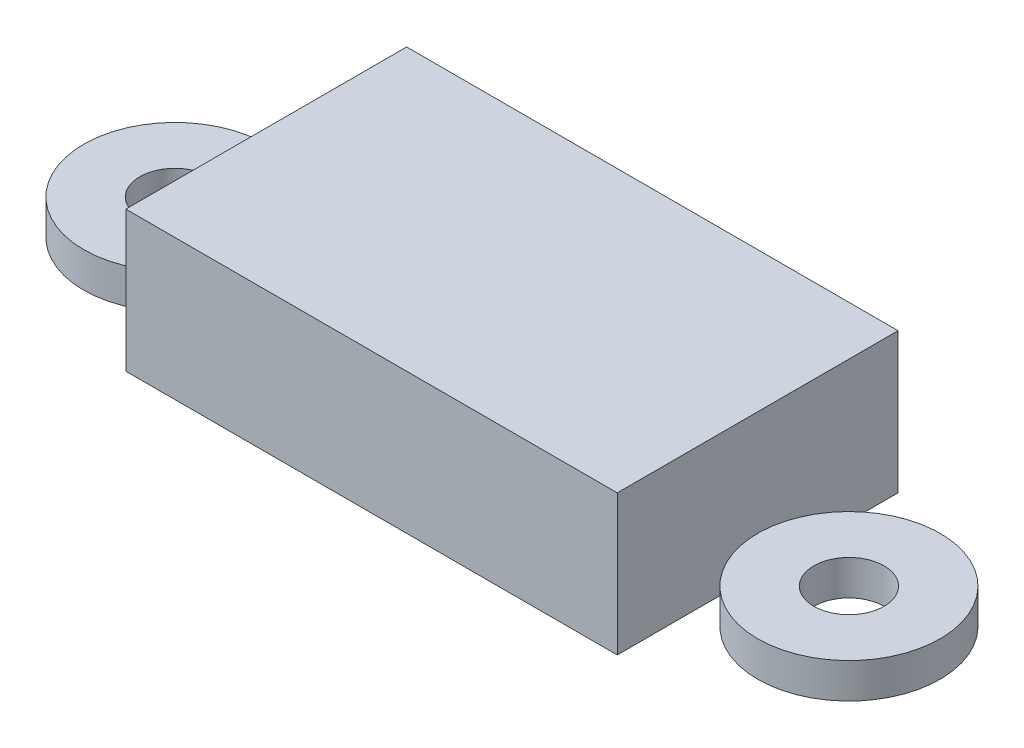
ISO-10303-21;
HEADER;
FILE_DESCRIPTION(('STEP AP214'),'2;1');
FILE_NAME('part.step','',(''),(''),'','','');
FILE_SCHEMA(('AUTOMOTIVE_DESIGN { 1 0 10303 214 1 1 1 1 }'));
ENDSEC;
DATA;
#1=APPLICATION_CONTEXT('core data for automotive mechanical design processes');
#2=APPLICATION_PROTOCOL_DEFINITION('international standard','automotive_design',2000,#1);
#3=PRODUCT_CONTEXT('',#1,'mechanical');
#4=PRODUCT('Part','Part','',(#3));
#5=PRODUCT_RELATED_PRODUCT_CATEGORY('part','',(#4));
#6=PRODUCT_DEFINITION_FORMATION('','',#4);
#7=PRODUCT_DEFINITION_CONTEXT('part definition',#1,'design');
#8=PRODUCT_DEFINITION('design','',#6,#7);
#9=PRODUCT_DEFINITION_SHAPE('','',#8);
#10=(LENGTH_UNIT() NAMED_UNIT(*) SI_UNIT(.MILLI.,.METRE.));
#11=(NAMED_UNIT(*) PLANE_ANGLE_UNIT() SI_UNIT($,.RADIAN.));
#12=(NAMED_UNIT(*) SI_UNIT($,.STERADIAN.) SOLID_ANGLE_UNIT());
#13=UNCERTAINTY_MEASURE_WITH_UNIT(LENGTH_MEASURE(1.E-05),#10,'distance_accuracy_value','');
#14=(GEOMETRIC_REPRESENTATION_CONTEXT(3) GLOBAL_UNCERTAINTY_ASSIGNED_CONTEXT((#13)) GLOBAL_UNIT_ASSIGNED_CONTEXT((#10,
#11,#12)) REPRESENTATION_CONTEXT('',''));
#15=CARTESIAN_POINT('',(0.,0.,0.));
#16=DIRECTION('',(0.,0.,1.));
#17=DIRECTION('',(1.,0.,0.));
#18=AXIS2_PLACEMENT_3D('',#15,#16,#17);
#19=CARTESIAN_POINT('',(-48.,5.,0.));
#20=DIRECTION('',(0.,1.,0.));
#21=DIRECTION('',(0.,0.,1.));
#22=AXIS2_PLACEMENT_3D('',#19,#20,#21);
#23=PLANE('',#22);
#24=CARTESIAN_POINT('',(-48.,5.,0.));
#25=DIRECTION('',(0.,1.,0.));
#26=DIRECTION('',(0.,0.,1.));
#27=AXIS2_PLACEMENT_3D('',#24,#25,#26);
#28=CIRCLE('',#27,13.);
#29=CARTESIAN_POINT('',(-48.,5.,13.));
#30=VERTEX_POINT('',#29);
#31=EDGE_CURVE('E12',#30,#30,#28,.T.);
#32=ORIENTED_EDGE('',*,*,#31,.T.);
#33=EDGE_LOOP('',(#32));
#34=FACE_BOUND('',#33,.T.);
#35=CARTESIAN_POINT('',(-48.,5.,0.));
#36=DIRECTION('',(0.,1.,0.));
#37=DIRECTION('',(0.,0.,1.));
#38=AXIS2_PLACEMENT_3D('',#35,#36,#37);
#39=CIRCLE('',#38,5.);
#40=CARTESIAN_POINT('',(-48.,5.,5.));
#41=VERTEX_POINT('',#40);
#42=EDGE_CURVE('E64',#41,#41,#39,.T.);
#43=ORIENTED_EDGE('',*,*,#42,.F.);
#44=EDGE_LOOP('',(#43));
#45=FACE_BOUND('',#44,.T.);
#46=ADVANCED_FACE('F53',(#34,#45),#23,.T.);
#47=CARTESIAN_POINT('',(-48.,0.,0.));
#48=DIRECTION('',(0.,1.,0.));
#49=DIRECTION('',(0.,0.,1.));
#50=AXIS2_PLACEMENT_3D('',#47,#48,#49);
#51=PLANE('',#50);
#52=CARTESIAN_POINT('',(-48.,0.,0.));
#53=DIRECTION('',(0.,1.,0.));
#54=DIRECTION('',(0.,0.,1.));
#55=AXIS2_PLACEMENT_3D('',#52,#53,#54);
#56=CIRCLE('',#55,13.);
#57=CARTESIAN_POINT('',(-48.,0.,13.));
#58=VERTEX_POINT('',#57);
#59=EDGE_CURVE('E57',#58,#58,#56,.T.);
#60=ORIENTED_EDGE('',*,*,#59,.F.);
#61=EDGE_LOOP('',(#60));
#62=FACE_BOUND('',#61,.T.);
#63=CARTESIAN_POINT('',(-48.,0.,0.));
#64=DIRECTION('',(0.,1.,0.));
#65=DIRECTION('',(0.,0.,1.));
#66=AXIS2_PLACEMENT_3D('',#63,#64,#65);
#67=CIRCLE('',#66,5.);
#68=CARTESIAN_POINT('',(-48.,0.,5.));
#69=VERTEX_POINT('',#68);
#70=EDGE_CURVE('E66',#69,#69,#67,.T.);
#71=ORIENTED_EDGE('',*,*,#70,.T.);
#72=EDGE_LOOP('',(#71));
#73=FACE_BOUND('',#72,.T.);
#74=ADVANCED_FACE('F76',(#62,#73),#51,.F.);
#75=CARTESIAN_POINT('',(-48.,5.,0.));
#76=DIRECTION('',(0.,-1.,0.));
#77=DIRECTION('',(0.,0.,-1.));
#78=AXIS2_PLACEMENT_3D('',#75,#76,#77);
#79=CYLINDRICAL_SURFACE('',#78,13.);
#80=ORIENTED_EDGE('',*,*,#31,.F.);
#81=EDGE_LOOP('',(#80));
#82=FACE_BOUND('',#81,.T.);
#83=ORIENTED_EDGE('',*,*,#59,.T.);
#84=EDGE_LOOP('',(#83));
#85=FACE_BOUND('',#84,.T.);
#86=ADVANCED_FACE('F55',(#82,#85),#79,.T.);
#87=CARTESIAN_POINT('',(-48.,5.,0.));
#88=DIRECTION('',(0.,-1.,0.));
#89=DIRECTION('',(0.,0.,-1.));
#90=AXIS2_PLACEMENT_3D('',#87,#88,#89);
#91=CYLINDRICAL_SURFACE('',#90,5.);
#92=ORIENTED_EDGE('',*,*,#42,.T.);
#93=EDGE_LOOP('',(#92));
#94=FACE_BOUND('',#93,.T.);
#95=ORIENTED_EDGE('',*,*,#70,.F.);
#96=EDGE_LOOP('',(#95));
#97=FACE_BOUND('',#96,.T.);
#98=ADVANCED_FACE('F72',(#94,#97),#91,.F.);
#99=CLOSED_SHELL('',(#46,#74,#86,#98));
#100=MANIFOLD_SOLID_BREP('B2',#99);
#101=CARTESIAN_POINT('',(48.,5.,0.));
#102=DIRECTION('',(0.,1.,0.));
#103=DIRECTION('',(0.,0.,1.));
#104=AXIS2_PLACEMENT_3D('',#101,#102,#103);
#105=PLANE('',#104);
#106=CARTESIAN_POINT('',(48.,5.,0.));
#107=DIRECTION('',(0.,1.,0.));
#108=DIRECTION('',(0.,0.,1.));
#109=AXIS2_PLACEMENT_3D('',#106,#107,#108);
#110=CIRCLE('',#109,13.);
#111=CARTESIAN_POINT('',(48.,5.,13.));
#112=VERTEX_POINT('',#111);
#113=EDGE_CURVE('E52',#112,#112,#110,.T.);
#114=ORIENTED_EDGE('',*,*,#113,.T.);
#115=EDGE_LOOP('',(#114));
#116=FACE_BOUND('',#115,.T.);
#117=CARTESIAN_POINT('',(48.,5.,0.));
#118=DIRECTION('',(0.,1.,0.));
#119=DIRECTION('',(0.,0.,1.));
#120=AXIS2_PLACEMENT_3D('',#117,#118,#119);
#121=CIRCLE('',#120,5.);
#122=CARTESIAN_POINT('',(48.,5.,5.));
#123=VERTEX_POINT('',#122);
#124=EDGE_CURVE('E134',#123,#123,#121,.T.);
#125=ORIENTED_EDGE('',*,*,#124,.F.);
#126=EDGE_LOOP('',(#125));
#127=FACE_BOUND('',#126,.T.);
#128=ADVANCED_FACE('F123',(#116,#127),#105,.T.);
#129=CARTESIAN_POINT('',(48.,0.,0.));
#130=DIRECTION('',(0.,1.,0.));
#131=DIRECTION('',(0.,0.,1.));
#132=AXIS2_PLACEMENT_3D('',#129,#130,#131);
#133=PLANE('',#132);
#134=CARTESIAN_POINT('',(48.,0.,0.));
#135=DIRECTION('',(0.,1.,0.));
#136=DIRECTION('',(0.,0.,1.));
#137=AXIS2_PLACEMENT_3D('',#134,#135,#136);
#138=CIRCLE('',#137,13.);
#139=CARTESIAN_POINT('',(48.,0.,13.));
#140=VERTEX_POINT('',#139);
#141=EDGE_CURVE('E127',#140,#140,#138,.T.);
#142=ORIENTED_EDGE('',*,*,#141,.F.);
#143=EDGE_LOOP('',(#142));
#144=FACE_BOUND('',#143,.T.);
#145=CARTESIAN_POINT('',(48.,0.,0.));
#146=DIRECTION('',(0.,1.,0.));
#147=DIRECTION('',(0.,0.,1.));
#148=AXIS2_PLACEMENT_3D('',#145,#146,#147);
#149=CIRCLE('',#148,5.);
#150=CARTESIAN_POINT('',(48.,0.,5.));
#151=VERTEX_POINT('',#150);
#152=EDGE_CURVE('E136',#151,#151,#149,.T.);
#153=ORIENTED_EDGE('',*,*,#152,.T.);
#154=EDGE_LOOP('',(#153));
#155=FACE_BOUND('',#154,.T.);
#156=ADVANCED_FACE('F146',(#144,#155),#133,.F.);
#157=CARTESIAN_POINT('',(48.,5.,0.));
#158=DIRECTION('',(0.,-1.,0.));
#159=DIRECTION('',(0.,0.,-1.));
#160=AXIS2_PLACEMENT_3D('',#157,#158,#159);
#161=CYLINDRICAL_SURFACE('',#160,13.);
#162=ORIENTED_EDGE('',*,*,#113,.F.);
#163=EDGE_LOOP('',(#162));
#164=FACE_BOUND('',#163,.T.);
#165=ORIENTED_EDGE('',*,*,#141,.T.);
#166=EDGE_LOOP('',(#165));
#167=FACE_BOUND('',#166,.T.);
#168=ADVANCED_FACE('F125',(#164,#167),#161,.T.);
#169=CARTESIAN_POINT('',(48.,5.,0.));
#170=DIRECTION('',(0.,-1.,0.));
#171=DIRECTION('',(0.,0.,-1.));
#172=AXIS2_PLACEMENT_3D('',#169,#170,#171);
#173=CYLINDRICAL_SURFACE('',#172,5.);
#174=ORIENTED_EDGE('',*,*,#124,.T.);
#175=EDGE_LOOP('',(#174));
#176=FACE_BOUND('',#175,.T.);
#177=ORIENTED_EDGE('',*,*,#152,.F.);
#178=EDGE_LOOP('',(#177));
#179=FACE_BOUND('',#178,.T.);
#180=ADVANCED_FACE('F142',(#176,#179),#173,.F.);
#181=CLOSED_SHELL('',(#128,#156,#168,#180));
#182=MANIFOLD_SOLID_BREP('B7',#181);
#183=CARTESIAN_POINT('',(-35.,20.,0.));
#184=DIRECTION('',(-1.,0.,0.));
#185=DIRECTION('',(0.,0.,1.));
#186=AXIS2_PLACEMENT_3D('',#183,#184,#185);
#187=PLANE('',#186);
#188=DIRECTION('',(0.,0.,-1.));
#189=VECTOR('',#188,1.);
#190=CARTESIAN_POINT('',(-35.,0.,0.));
#191=LINE('',#190,#189);
#192=CARTESIAN_POINT('',(-35.,0.,20.));
#193=VERTEX_POINT('',#192);
#194=CARTESIAN_POINT('',(-35.,0.,-20.));
#195=VERTEX_POINT('',#194);
#196=EDGE_CURVE('E228',#193,#195,#191,.T.);
#197=ORIENTED_EDGE('',*,*,#196,.F.);
#198=DIRECTION('',(0.,-1.,0.));
#199=VECTOR('',#198,1.);
#200=CARTESIAN_POINT('',(-35.,20.,20.));
#201=LINE('',#200,#199);
#202=CARTESIAN_POINT('',(-35.,20.,20.));
#203=VERTEX_POINT('',#202);
#204=EDGE_CURVE('E121',#203,#193,#201,.T.);
#205=ORIENTED_EDGE('',*,*,#204,.F.);
#206=DIRECTION('',(0.,0.,-1.));
#207=VECTOR('',#206,1.);
#208=CARTESIAN_POINT('',(-35.,20.,0.));
#209=LINE('',#208,#207);
#210=CARTESIAN_POINT('',(-35.,20.,-20.));
#211=VERTEX_POINT('',#210);
#212=EDGE_CURVE('E294',#203,#211,#209,.T.);
#213=ORIENTED_EDGE('',*,*,#212,.T.);
#214=DIRECTION('',(0.,-1.,0.));
#215=VECTOR('',#214,1.);
#216=CARTESIAN_POINT('',(-35.,20.,-20.));
#217=LINE('',#216,#215);
#218=EDGE_CURVE('E303',#211,#195,#217,.T.);
#219=ORIENTED_EDGE('',*,*,#218,.T.);
#220=EDGE_LOOP('',(#197,#205,#213,#219));
#221=FACE_BOUND('',#220,.T.);
#222=ADVANCED_FACE('F184',(#221),#187,.T.);
#223=CARTESIAN_POINT('',(0.,20.,20.));
#224=DIRECTION('',(0.,0.,1.));
#225=DIRECTION('',(1.,0.,0.));
#226=AXIS2_PLACEMENT_3D('',#223,#224,#225);
#227=PLANE('',#226);
#228=DIRECTION('',(-1.,0.,0.));
#229=VECTOR('',#228,1.);
#230=CARTESIAN_POINT('',(0.,0.,20.));
#231=LINE('',#230,#229);
#232=CARTESIAN_POINT('',(35.,0.,20.));
#233=VERTEX_POINT('',#232);
#234=EDGE_CURVE('E305',#233,#193,#231,.T.);
#235=ORIENTED_EDGE('',*,*,#234,.F.);
#236=DIRECTION('',(0.,-1.,0.));
#237=VECTOR('',#236,1.);
#238=CARTESIAN_POINT('',(35.,20.,20.));
#239=LINE('',#238,#237);
#240=CARTESIAN_POINT('',(35.,20.,20.));
#241=VERTEX_POINT('',#240);
#242=EDGE_CURVE('E191',#241,#233,#239,.T.);
#243=ORIENTED_EDGE('',*,*,#242,.F.);
#244=DIRECTION('',(-1.,0.,0.));
#245=VECTOR('',#244,1.);
#246=CARTESIAN_POINT('',(0.,20.,20.));
#247=LINE('',#246,#245);
#248=EDGE_CURVE('E296',#241,#203,#247,.T.);
#249=ORIENTED_EDGE('',*,*,#248,.T.);
#250=ORIENTED_EDGE('',*,*,#204,.T.);
#251=EDGE_LOOP('',(#235,#243,#249,#250));
#252=FACE_BOUND('',#251,.T.);
#253=ADVANCED_FACE('F323',(#252),#227,.T.);
#254=CARTESIAN_POINT('',(35.,20.,0.));
#255=DIRECTION('',(-1.,0.,0.));
#256=DIRECTION('',(0.,0.,1.));
#257=AXIS2_PLACEMENT_3D('',#254,#255,#256);
#258=PLANE('',#257);
#259=DIRECTION('',(0.,0.,-1.));
#260=VECTOR('',#259,1.);
#261=CARTESIAN_POINT('',(35.,0.,0.));
#262=LINE('',#261,#260);
#263=CARTESIAN_POINT('',(35.,0.,-20.));
#264=VERTEX_POINT('',#263);
#265=EDGE_CURVE('E307',#233,#264,#262,.T.);
#266=ORIENTED_EDGE('',*,*,#265,.T.);
#267=DIRECTION('',(0.,-1.,0.));
#268=VECTOR('',#267,1.);
#269=CARTESIAN_POINT('',(35.,20.,-20.));
#270=LINE('',#269,#268);
#271=CARTESIAN_POINT('',(35.,20.,-20.));
#272=VERTEX_POINT('',#271);
#273=EDGE_CURVE('E312',#272,#264,#270,.T.);
#274=ORIENTED_EDGE('',*,*,#273,.F.);
#275=DIRECTION('',(0.,0.,-1.));
#276=VECTOR('',#275,1.);
#277=CARTESIAN_POINT('',(35.,20.,0.));
#278=LINE('',#277,#276);
#279=EDGE_CURVE('E300',#241,#272,#278,.T.);
#280=ORIENTED_EDGE('',*,*,#279,.F.);
#281=ORIENTED_EDGE('',*,*,#242,.T.);
#282=EDGE_LOOP('',(#266,#274,#280,#281));
#283=FACE_BOUND('',#282,.T.);
#284=ADVANCED_FACE('F317',(#283),#258,.F.);
#285=CARTESIAN_POINT('',(0.,20.,-20.));
#286=DIRECTION('',(0.,0.,1.));
#287=DIRECTION('',(1.,0.,0.));
#288=AXIS2_PLACEMENT_3D('',#285,#286,#287);
#289=PLANE('',#288);
#290=DIRECTION('',(1.,0.,0.));
#291=VECTOR('',#290,1.);
#292=CARTESIAN_POINT('',(33.1027972250724,17.9216219415183,-20.));
#293=LINE('',#292,#291);
#294=CARTESIAN_POINT('',(-33.1027972250724,17.9216219415183,-20.));
#295=VERTEX_POINT('',#294);
#296=CARTESIAN_POINT('',(33.1027972250724,17.9216219415183,-20.));
#297=VERTEX_POINT('',#296);
#298=EDGE_CURVE('E285',#295,#297,#293,.T.);
#299=ORIENTED_EDGE('',*,*,#298,.F.);
#300=DIRECTION('',(0.,1.,0.));
#301=VECTOR('',#300,1.);
#302=CARTESIAN_POINT('',(-33.1027972250724,1.98323809240936,-20.));
#303=LINE('',#302,#301);
#304=CARTESIAN_POINT('',(-33.1027972250724,1.98323809240936,-20.));
#305=VERTEX_POINT('',#304);
#306=EDGE_CURVE('E198',#305,#295,#303,.T.);
#307=ORIENTED_EDGE('',*,*,#306,.F.);
#308=DIRECTION('',(-1.,0.,0.));
#309=VECTOR('',#308,1.);
#310=CARTESIAN_POINT('',(33.1027972250724,1.98323809240936,-20.));
#311=LINE('',#310,#309);
#312=CARTESIAN_POINT('',(33.1027972250724,1.98323809240936,-20.));
#313=VERTEX_POINT('',#312);
#314=EDGE_CURVE('E276',#313,#305,#311,.T.);
#315=ORIENTED_EDGE('',*,*,#314,.F.);
#316=DIRECTION('',(0.,-1.,0.));
#317=VECTOR('',#316,1.);
#318=CARTESIAN_POINT('',(33.1027972250724,1.98323809240936,-20.));
#319=LINE('',#318,#317);
#320=EDGE_CURVE('E279',#297,#313,#319,.T.);
#321=ORIENTED_EDGE('',*,*,#320,.F.);
#322=EDGE_LOOP('',(#299,#307,#315,#321));
#323=FACE_BOUND('',#322,.T.);
#324=DIRECTION('',(-1.,0.,0.));
#325=VECTOR('',#324,1.);
#326=CARTESIAN_POINT('',(0.,0.,-20.));
#327=LINE('',#326,#325);
#328=EDGE_CURVE('E297',#264,#195,#327,.T.);
#329=ORIENTED_EDGE('',*,*,#328,.T.);
#330=ORIENTED_EDGE('',*,*,#218,.F.);
#331=DIRECTION('',(-1.,0.,0.));
#332=VECTOR('',#331,1.);
#333=CARTESIAN_POINT('',(0.,20.,-20.));
#334=LINE('',#333,#332);
#335=EDGE_CURVE('E207',#272,#211,#334,.T.);
#336=ORIENTED_EDGE('',*,*,#335,.F.);
#337=ORIENTED_EDGE('',*,*,#273,.T.);
#338=EDGE_LOOP('',(#329,#330,#336,#337));
#339=FACE_BOUND('',#338,.T.);
#340=ADVANCED_FACE('F325',(#323,#339),#289,.F.);
#341=CARTESIAN_POINT('',(0.,20.,0.));
#342=DIRECTION('',(0.,1.,0.));
#343=DIRECTION('',(0.,0.,1.));
#344=AXIS2_PLACEMENT_3D('',#341,#342,#343);
#345=PLANE('',#344);
#346=ORIENTED_EDGE('',*,*,#212,.F.);
#347=ORIENTED_EDGE('',*,*,#248,.F.);
#348=ORIENTED_EDGE('',*,*,#279,.T.);
#349=ORIENTED_EDGE('',*,*,#335,.T.);
#350=EDGE_LOOP('',(#346,#347,#348,#349));
#351=FACE_BOUND('',#350,.T.);
#352=ADVANCED_FACE('F327',(#351),#345,.T.);
#353=CARTESIAN_POINT('',(0.,0.,0.));
#354=DIRECTION('',(0.,1.,0.));
#355=DIRECTION('',(0.,0.,1.));
#356=AXIS2_PLACEMENT_3D('',#353,#354,#355);
#357=PLANE('',#356);
#358=ORIENTED_EDGE('',*,*,#196,.T.);
#359=ORIENTED_EDGE('',*,*,#328,.F.);
#360=ORIENTED_EDGE('',*,*,#265,.F.);
#361=ORIENTED_EDGE('',*,*,#234,.T.);
#362=EDGE_LOOP('',(#358,#359,#360,#361));
#363=FACE_BOUND('',#362,.T.);
#364=ADVANCED_FACE('F322',(#363),#357,.F.);
#365=CARTESIAN_POINT('',(-33.1027972250724,1.98323809240936,10.));
#366=DIRECTION('',(-1.,0.,0.));
#367=DIRECTION('',(0.,0.,1.));
#368=AXIS2_PLACEMENT_3D('',#365,#366,#367);
#369=PLANE('',#368);
#370=ORIENTED_EDGE('',*,*,#306,.T.);
#371=DIRECTION('',(0.,0.,-1.));
#372=VECTOR('',#371,1.);
#373=CARTESIAN_POINT('',(-33.1027972250724,17.9216219415183,10.));
#374=LINE('',#373,#372);
#375=CARTESIAN_POINT('',(-33.1027972250724,17.9216219415183,10.));
#376=VERTEX_POINT('',#375);
#377=EDGE_CURVE('E254',#376,#295,#374,.T.);
#378=ORIENTED_EDGE('',*,*,#377,.F.);
#379=DIRECTION('',(0.,1.,0.));
#380=VECTOR('',#379,1.);
#381=CARTESIAN_POINT('',(-33.1027972250724,1.98323809240936,10.));
#382=LINE('',#381,#380);
#383=CARTESIAN_POINT('',(-33.1027972250724,1.98323809240936,10.));
#384=VERTEX_POINT('',#383);
#385=EDGE_CURVE('E258',#384,#376,#382,.T.);
#386=ORIENTED_EDGE('',*,*,#385,.F.);
#387=DIRECTION('',(0.,0.,-1.));
#388=VECTOR('',#387,1.);
#389=CARTESIAN_POINT('',(-33.1027972250724,1.98323809240936,10.));
#390=LINE('',#389,#388);
#391=EDGE_CURVE('E289',#384,#305,#390,.T.);
#392=ORIENTED_EDGE('',*,*,#391,.T.);
#393=EDGE_LOOP('',(#370,#378,#386,#392));
#394=FACE_BOUND('',#393,.T.);
#395=ADVANCED_FACE('F256',(#394),#369,.F.);
#396=CARTESIAN_POINT('',(33.1027972250724,1.98323809240936,10.));
#397=DIRECTION('',(0.,-1.,0.));
#398=DIRECTION('',(0.,0.,-1.));
#399=AXIS2_PLACEMENT_3D('',#396,#397,#398);
#400=PLANE('',#399);
#401=ORIENTED_EDGE('',*,*,#314,.T.);
#402=ORIENTED_EDGE('',*,*,#391,.F.);
#403=DIRECTION('',(-1.,0.,0.));
#404=VECTOR('',#403,1.);
#405=CARTESIAN_POINT('',(33.1027972250724,1.98323809240936,10.));
#406=LINE('',#405,#404);
#407=CARTESIAN_POINT('',(33.1027972250724,1.98323809240936,10.));
#408=VERTEX_POINT('',#407);
#409=EDGE_CURVE('E264',#408,#384,#406,.T.);
#410=ORIENTED_EDGE('',*,*,#409,.F.);
#411=DIRECTION('',(0.,0.,-1.));
#412=VECTOR('',#411,1.);
#413=CARTESIAN_POINT('',(33.1027972250724,1.98323809240936,10.));
#414=LINE('',#413,#412);
#415=EDGE_CURVE('E291',#408,#313,#414,.T.);
#416=ORIENTED_EDGE('',*,*,#415,.T.);
#417=EDGE_LOOP('',(#401,#402,#410,#416));
#418=FACE_BOUND('',#417,.T.);
#419=ADVANCED_FACE('F370',(#418),#400,.F.);
#420=CARTESIAN_POINT('',(33.1027972250724,1.98323809240936,10.));
#421=DIRECTION('',(1.,0.,0.));
#422=DIRECTION('',(0.,0.,-1.));
#423=AXIS2_PLACEMENT_3D('',#420,#421,#422);
#424=PLANE('',#423);
#425=ORIENTED_EDGE('',*,*,#320,.T.);
#426=ORIENTED_EDGE('',*,*,#415,.F.);
#427=DIRECTION('',(0.,-1.,0.));
#428=VECTOR('',#427,1.);
#429=CARTESIAN_POINT('',(33.1027972250724,1.98323809240936,10.));
#430=LINE('',#429,#428);
#431=CARTESIAN_POINT('',(33.1027972250724,17.9216219415183,10.));
#432=VERTEX_POINT('',#431);
#433=EDGE_CURVE('E272',#432,#408,#430,.T.);
#434=ORIENTED_EDGE('',*,*,#433,.F.);
#435=DIRECTION('',(0.,0.,-1.));
#436=VECTOR('',#435,1.);
#437=CARTESIAN_POINT('',(33.1027972250724,17.9216219415183,10.));
#438=LINE('',#437,#436);
#439=EDGE_CURVE('E263',#432,#297,#438,.T.);
#440=ORIENTED_EDGE('',*,*,#439,.T.);
#441=EDGE_LOOP('',(#425,#426,#434,#440));
#442=FACE_BOUND('',#441,.T.);
#443=ADVANCED_FACE('F376',(#442),#424,.F.);
#444=CARTESIAN_POINT('',(33.1027972250724,17.9216219415183,10.));
#445=DIRECTION('',(0.,1.,0.));
#446=DIRECTION('',(0.,0.,1.));
#447=AXIS2_PLACEMENT_3D('',#444,#445,#446);
#448=PLANE('',#447);
#449=ORIENTED_EDGE('',*,*,#298,.T.);
#450=ORIENTED_EDGE('',*,*,#439,.F.);
#451=DIRECTION('',(1.,0.,0.));
#452=VECTOR('',#451,1.);
#453=CARTESIAN_POINT('',(33.1027972250724,17.9216219415183,10.));
#454=LINE('',#453,#452);
#455=EDGE_CURVE('E267',#376,#432,#454,.T.);
#456=ORIENTED_EDGE('',*,*,#455,.F.);
#457=ORIENTED_EDGE('',*,*,#377,.T.);
#458=EDGE_LOOP('',(#449,#450,#456,#457));
#459=FACE_BOUND('',#458,.T.);
#460=ADVANCED_FACE('F268',(#459),#448,.F.);
#461=CARTESIAN_POINT('',(0.,0.,10.));
#462=DIRECTION('',(0.,0.,1.));
#463=DIRECTION('',(1.,0.,0.));
#464=AXIS2_PLACEMENT_3D('',#461,#462,#463);
#465=PLANE('',#464);
#466=ORIENTED_EDGE('',*,*,#385,.T.);
#467=ORIENTED_EDGE('',*,*,#455,.T.);
#468=ORIENTED_EDGE('',*,*,#433,.T.);
#469=ORIENTED_EDGE('',*,*,#409,.T.);
#470=EDGE_LOOP('',(#466,#467,#468,#469));
#471=FACE_BOUND('',#470,.T.);
#472=ADVANCED_FACE('F274',(#471),#465,.F.);
#473=CLOSED_SHELL('',(#222,#253,#284,#340,#352,#364,#395,#419,#443,#460,#472));
#474=MANIFOLD_SOLID_BREP('B47',#473);
#475=ADVANCED_BREP_SHAPE_REPRESENTATION('',(#18,#100,#182,#474),#14);
#476=SHAPE_DEFINITION_REPRESENTATION(#9,#475);
ENDSEC;
END-ISO-10303-21;
